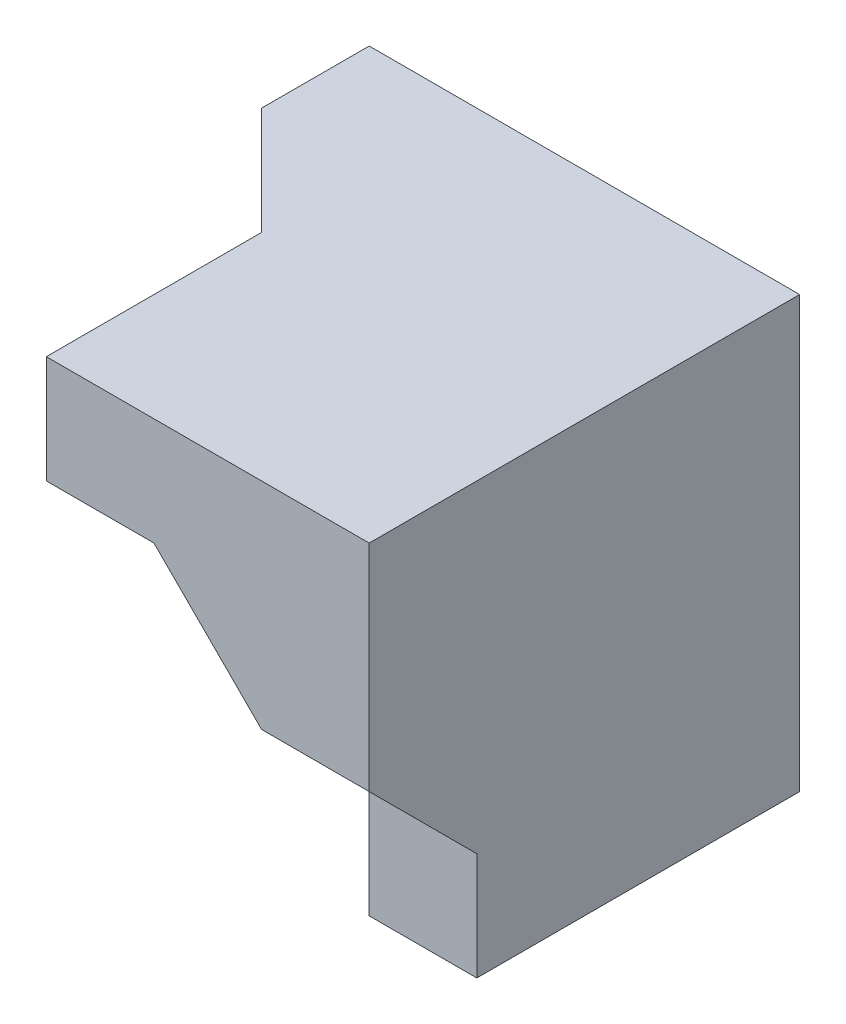
ISO-10303-21;
HEADER;
FILE_DESCRIPTION(('STEP AP214'),'2;1');
FILE_NAME('part.step','',(''),(''),'','','');
FILE_SCHEMA(('AUTOMOTIVE_DESIGN { 1 0 10303 214 1 1 1 1 }'));
ENDSEC;
DATA;
#1=APPLICATION_CONTEXT('core data for automotive mechanical design processes');
#2=APPLICATION_PROTOCOL_DEFINITION('international standard','automotive_design',2000,#1);
#3=PRODUCT_CONTEXT('',#1,'mechanical');
#4=PRODUCT('Part','Part','',(#3));
#5=PRODUCT_RELATED_PRODUCT_CATEGORY('part','',(#4));
#6=PRODUCT_DEFINITION_FORMATION('','',#4);
#7=PRODUCT_DEFINITION_CONTEXT('part definition',#1,'design');
#8=PRODUCT_DEFINITION('design','',#6,#7);
#9=PRODUCT_DEFINITION_SHAPE('','',#8);
#10=(LENGTH_UNIT() NAMED_UNIT(*) SI_UNIT(.MILLI.,.METRE.));
#11=(NAMED_UNIT(*) PLANE_ANGLE_UNIT() SI_UNIT($,.RADIAN.));
#12=(NAMED_UNIT(*) SI_UNIT($,.STERADIAN.) SOLID_ANGLE_UNIT());
#13=UNCERTAINTY_MEASURE_WITH_UNIT(LENGTH_MEASURE(1.E-05),#10,'distance_accuracy_value','');
#14=(GEOMETRIC_REPRESENTATION_CONTEXT(3) GLOBAL_UNCERTAINTY_ASSIGNED_CONTEXT((#13)) GLOBAL_UNIT_ASSIGNED_CONTEXT((#10,
#11,#12)) REPRESENTATION_CONTEXT('',''));
#15=CARTESIAN_POINT('',(0.,0.,0.));
#16=DIRECTION('',(0.,0.,1.));
#17=DIRECTION('',(1.,0.,0.));
#18=AXIS2_PLACEMENT_3D('',#15,#16,#17);
#19=CARTESIAN_POINT('',(0.,0.,20.));
#20=DIRECTION('',(0.,0.,-1.));
#21=DIRECTION('',(-1.,0.,0.));
#22=AXIS2_PLACEMENT_3D('',#19,#20,#21);
#23=PLANE('',#22);
#24=DIRECTION('',(0.,-1.,0.));
#25=VECTOR('',#24,1.);
#26=CARTESIAN_POINT('',(10.,30.,20.));
#27=LINE('',#26,#25);
#28=CARTESIAN_POINT('',(10.,30.,20.));
#29=VERTEX_POINT('',#28);
#30=CARTESIAN_POINT('',(9.99999999999999,20.,20.));
#31=VERTEX_POINT('',#30);
#32=EDGE_CURVE('E550',#29,#31,#27,.T.);
#33=ORIENTED_EDGE('',*,*,#32,.F.);
#34=DIRECTION('',(1.,0.,0.));
#35=VECTOR('',#34,1.);
#36=CARTESIAN_POINT('',(0.,30.,20.));
#37=LINE('',#36,#35);
#38=CARTESIAN_POINT('',(0.,30.,20.));
#39=VERTEX_POINT('',#38);
#40=EDGE_CURVE('E212',#39,#29,#37,.T.);
#41=ORIENTED_EDGE('',*,*,#40,.F.);
#42=DIRECTION('',(0.,1.,0.));
#43=VECTOR('',#42,1.);
#44=CARTESIAN_POINT('',(0.,40.,20.));
#45=LINE('',#44,#43);
#46=CARTESIAN_POINT('',(0.,20.,20.));
#47=VERTEX_POINT('',#46);
#48=EDGE_CURVE('E226',#47,#39,#45,.T.);
#49=ORIENTED_EDGE('',*,*,#48,.F.);
#50=DIRECTION('',(1.,0.,0.));
#51=VECTOR('',#50,1.);
#52=CARTESIAN_POINT('',(0.,20.,20.));
#53=LINE('',#52,#51);
#54=EDGE_CURVE('E235',#47,#31,#53,.T.);
#55=ORIENTED_EDGE('',*,*,#54,.T.);
#56=EDGE_LOOP('',(#33,#41,#49,#55));
#57=FACE_BOUND('',#56,.T.);
#58=ADVANCED_FACE('F35',(#57),#23,.F.);
#59=CARTESIAN_POINT('',(30.,0.,0.));
#60=DIRECTION('',(1.,0.,0.));
#61=DIRECTION('',(0.,0.,-1.));
#62=AXIS2_PLACEMENT_3D('',#59,#60,#61);
#63=PLANE('',#62);
#64=DIRECTION('',(0.,1.,0.));
#65=VECTOR('',#64,1.);
#66=CARTESIAN_POINT('',(30.,0.,30.));
#67=LINE('',#66,#65);
#68=CARTESIAN_POINT('',(30.,0.,30.));
#69=VERTEX_POINT('',#68);
#70=CARTESIAN_POINT('',(30.,9.99999999999999,30.));
#71=VERTEX_POINT('',#70);
#72=EDGE_CURVE('E163',#69,#71,#67,.T.);
#73=ORIENTED_EDGE('',*,*,#72,.T.);
#74=DIRECTION('',(0.,-0.707106781186547,-0.707106781186548));
#75=VECTOR('',#74,1.);
#76=CARTESIAN_POINT('',(30.,0.,20.));
#77=LINE('',#76,#75);
#78=CARTESIAN_POINT('',(30.,0.,20.));
#79=VERTEX_POINT('',#78);
#80=EDGE_CURVE('E146',#71,#79,#77,.T.);
#81=ORIENTED_EDGE('',*,*,#80,.T.);
#82=DIRECTION('',(0.,0.,1.));
#83=VECTOR('',#82,1.);
#84=CARTESIAN_POINT('',(30.,0.,0.));
#85=LINE('',#84,#83);
#86=EDGE_CURVE('E160',#79,#69,#85,.T.);
#87=ORIENTED_EDGE('',*,*,#86,.T.);
#88=EDGE_LOOP('',(#73,#81,#87));
#89=FACE_BOUND('',#88,.T.);
#90=ADVANCED_FACE('F158',(#89),#63,.F.);
#91=CARTESIAN_POINT('',(10.,40.,-5.00000000000001));
#92=DIRECTION('',(1.,0.,0.));
#93=DIRECTION('',(0.,1.,0.));
#94=AXIS2_PLACEMENT_3D('',#91,#92,#93);
#95=PLANE('',#94);
#96=DIRECTION('',(0.,0.,1.));
#97=VECTOR('',#96,1.);
#98=CARTESIAN_POINT('',(10.,20.,20.));
#99=LINE('',#98,#97);
#100=CARTESIAN_POINT('',(10.,20.,0.));
#101=VERTEX_POINT('',#100);
#102=CARTESIAN_POINT('',(10.,19.9999999999998,10.));
#103=VERTEX_POINT('',#102);
#104=EDGE_CURVE('E224',#101,#103,#99,.T.);
#105=ORIENTED_EDGE('',*,*,#104,.F.);
#106=DIRECTION('',(0.,-1.,0.));
#107=VECTOR('',#106,1.);
#108=CARTESIAN_POINT('',(10.,0.,0.));
#109=LINE('',#108,#107);
#110=CARTESIAN_POINT('',(10.,10.,0.));
#111=VERTEX_POINT('',#110);
#112=EDGE_CURVE('E44',#101,#111,#109,.T.);
#113=ORIENTED_EDGE('',*,*,#112,.T.);
#114=DIRECTION('',(0.,0.,1.));
#115=VECTOR('',#114,1.);
#116=CARTESIAN_POINT('',(10.,10.,-5.00000000000001));
#117=LINE('',#116,#115);
#118=CARTESIAN_POINT('',(10.,10.,10.));
#119=VERTEX_POINT('',#118);
#120=EDGE_CURVE('E11',#111,#119,#117,.T.);
#121=ORIENTED_EDGE('',*,*,#120,.T.);
#122=DIRECTION('',(0.,-1.,0.));
#123=VECTOR('',#122,1.);
#124=CARTESIAN_POINT('',(10.,19.9999999999998,10.));
#125=LINE('',#124,#123);
#126=EDGE_CURVE('E242',#103,#119,#125,.T.);
#127=ORIENTED_EDGE('',*,*,#126,.F.);
#128=EDGE_LOOP('',(#105,#113,#121,#127));
#129=FACE_BOUND('',#128,.T.);
#130=ADVANCED_FACE('F317',(#129),#95,.F.);
#131=CARTESIAN_POINT('',(30.,0.,0.));
#132=DIRECTION('',(0.,1.,0.));
#133=DIRECTION('',(0.,0.,1.));
#134=AXIS2_PLACEMENT_3D('',#131,#132,#133);
#135=PLANE('',#134);
#136=ORIENTED_EDGE('',*,*,#86,.F.);
#137=DIRECTION('',(0.,0.,1.));
#138=VECTOR('',#137,1.);
#139=CARTESIAN_POINT('',(30.,0.,10.));
#140=LINE('',#139,#138);
#141=CARTESIAN_POINT('',(30.,0.,10.));
#142=VERTEX_POINT('',#141);
#143=EDGE_CURVE('E166',#142,#79,#140,.T.);
#144=ORIENTED_EDGE('',*,*,#143,.F.);
#145=DIRECTION('',(1.,0.,0.));
#146=VECTOR('',#145,1.);
#147=CARTESIAN_POINT('',(20.,0.,10.));
#148=LINE('',#147,#146);
#149=CARTESIAN_POINT('',(20.,0.,10.));
#150=VERTEX_POINT('',#149);
#151=EDGE_CURVE('E153',#150,#142,#148,.T.);
#152=ORIENTED_EDGE('',*,*,#151,.F.);
#153=DIRECTION('',(0.,0.,1.));
#154=VECTOR('',#153,1.);
#155=CARTESIAN_POINT('',(20.,0.,-5.00000000000001));
#156=LINE('',#155,#154);
#157=CARTESIAN_POINT('',(20.,0.,0.));
#158=VERTEX_POINT('',#157);
#159=EDGE_CURVE('E244',#158,#150,#156,.T.);
#160=ORIENTED_EDGE('',*,*,#159,.F.);
#161=DIRECTION('',(1.,0.,0.));
#162=VECTOR('',#161,1.);
#163=CARTESIAN_POINT('',(0.,0.,0.));
#164=LINE('',#163,#162);
#165=CARTESIAN_POINT('',(40.,0.,0.));
#166=VERTEX_POINT('',#165);
#167=EDGE_CURVE('E249',#158,#166,#164,.T.);
#168=ORIENTED_EDGE('',*,*,#167,.T.);
#169=DIRECTION('',(0.,0.,1.));
#170=VECTOR('',#169,1.);
#171=CARTESIAN_POINT('',(40.,0.,0.));
#172=LINE('',#171,#170);
#173=CARTESIAN_POINT('',(40.,0.,30.));
#174=VERTEX_POINT('',#173);
#175=EDGE_CURVE('E181',#166,#174,#172,.T.);
#176=ORIENTED_EDGE('',*,*,#175,.T.);
#177=DIRECTION('',(1.,0.,0.));
#178=VECTOR('',#177,1.);
#179=CARTESIAN_POINT('',(30.,0.,30.));
#180=LINE('',#179,#178);
#181=EDGE_CURVE('E178',#69,#174,#180,.T.);
#182=ORIENTED_EDGE('',*,*,#181,.F.);
#183=EDGE_LOOP('',(#136,#144,#152,#160,#168,#176,#182));
#184=FACE_BOUND('',#183,.T.);
#185=ADVANCED_FACE('F176',(#184),#135,.F.);
#186=CARTESIAN_POINT('',(30.,0.,30.));
#187=DIRECTION('',(0.,0.,-1.));
#188=DIRECTION('',(-1.,0.,0.));
#189=AXIS2_PLACEMENT_3D('',#186,#187,#188);
#190=PLANE('',#189);
#191=DIRECTION('',(0.,1.,0.));
#192=VECTOR('',#191,1.);
#193=CARTESIAN_POINT('',(40.,0.,30.));
#194=LINE('',#193,#192);
#195=CARTESIAN_POINT('',(40.,10.,30.));
#196=VERTEX_POINT('',#195);
#197=EDGE_CURVE('E190',#174,#196,#194,.T.);
#198=ORIENTED_EDGE('',*,*,#197,.T.);
#199=DIRECTION('',(-1.,0.,0.));
#200=VECTOR('',#199,1.);
#201=CARTESIAN_POINT('',(40.,10.,30.));
#202=LINE('',#201,#200);
#203=EDGE_CURVE('E203',#196,#71,#202,.T.);
#204=ORIENTED_EDGE('',*,*,#203,.T.);
#205=ORIENTED_EDGE('',*,*,#72,.F.);
#206=ORIENTED_EDGE('',*,*,#181,.T.);
#207=EDGE_LOOP('',(#198,#204,#205,#206));
#208=FACE_BOUND('',#207,.T.);
#209=ADVANCED_FACE('F37',(#208),#190,.F.);
#210=CARTESIAN_POINT('',(40.,0.,0.));
#211=DIRECTION('',(1.,0.,0.));
#212=DIRECTION('',(0.,0.,-1.));
#213=AXIS2_PLACEMENT_3D('',#210,#211,#212);
#214=PLANE('',#213);
#215=DIRECTION('',(0.,0.,-1.));
#216=VECTOR('',#215,1.);
#217=CARTESIAN_POINT('',(40.,40.,20.));
#218=LINE('',#217,#216);
#219=CARTESIAN_POINT('',(40.,40.,40.));
#220=VERTEX_POINT('',#219);
#221=CARTESIAN_POINT('',(40.,40.,0.));
#222=VERTEX_POINT('',#221);
#223=EDGE_CURVE('E193',#220,#222,#218,.T.);
#224=ORIENTED_EDGE('',*,*,#223,.F.);
#225=DIRECTION('',(0.,1.,0.));
#226=VECTOR('',#225,1.);
#227=CARTESIAN_POINT('',(40.,20.,40.));
#228=LINE('',#227,#226);
#229=CARTESIAN_POINT('',(40.,20.,40.));
#230=VERTEX_POINT('',#229);
#231=EDGE_CURVE('E207',#230,#220,#228,.T.);
#232=ORIENTED_EDGE('',*,*,#231,.F.);
#233=DIRECTION('',(0.,0.707106781186547,0.707106781186548));
#234=VECTOR('',#233,1.);
#235=CARTESIAN_POINT('',(40.,10.,30.));
#236=LINE('',#235,#234);
#237=EDGE_CURVE('E199',#196,#230,#236,.T.);
#238=ORIENTED_EDGE('',*,*,#237,.F.);
#239=ORIENTED_EDGE('',*,*,#197,.F.);
#240=ORIENTED_EDGE('',*,*,#175,.F.);
#241=DIRECTION('',(0.,1.,0.));
#242=VECTOR('',#241,1.);
#243=CARTESIAN_POINT('',(40.,0.,0.));
#244=LINE('',#243,#242);
#245=EDGE_CURVE('E251',#166,#222,#244,.T.);
#246=ORIENTED_EDGE('',*,*,#245,.T.);
#247=EDGE_LOOP('',(#224,#232,#238,#239,#240,#246));
#248=FACE_BOUND('',#247,.T.);
#249=ADVANCED_FACE('F307',(#248),#214,.T.);
#250=CARTESIAN_POINT('',(0.,40.,20.));
#251=DIRECTION('',(0.,-1.,0.));
#252=DIRECTION('',(0.,0.,-1.));
#253=AXIS2_PLACEMENT_3D('',#250,#251,#252);
#254=PLANE('',#253);
#255=DIRECTION('',(-0.707106781186548,0.,-0.707106781186548));
#256=VECTOR('',#255,1.);
#257=CARTESIAN_POINT('',(10.,40.,20.));
#258=LINE('',#257,#256);
#259=CARTESIAN_POINT('',(10.,40.,20.));
#260=VERTEX_POINT('',#259);
#261=CARTESIAN_POINT('',(0.,40.,10.));
#262=VERTEX_POINT('',#261);
#263=EDGE_CURVE('E214',#260,#262,#258,.T.);
#264=ORIENTED_EDGE('',*,*,#263,.F.);
#265=DIRECTION('',(0.,0.,-1.));
#266=VECTOR('',#265,1.);
#267=CARTESIAN_POINT('',(10.,40.,40.));
#268=LINE('',#267,#266);
#269=CARTESIAN_POINT('',(10.,40.,40.));
#270=VERTEX_POINT('',#269);
#271=EDGE_CURVE('E281',#270,#260,#268,.T.);
#272=ORIENTED_EDGE('',*,*,#271,.F.);
#273=DIRECTION('',(-1.,0.,0.));
#274=VECTOR('',#273,1.);
#275=CARTESIAN_POINT('',(40.,40.,40.));
#276=LINE('',#275,#274);
#277=EDGE_CURVE('E220',#220,#270,#276,.T.);
#278=ORIENTED_EDGE('',*,*,#277,.F.);
#279=ORIENTED_EDGE('',*,*,#223,.T.);
#280=DIRECTION('',(-1.,0.,0.));
#281=VECTOR('',#280,1.);
#282=CARTESIAN_POINT('',(0.,40.,0.));
#283=LINE('',#282,#281);
#284=CARTESIAN_POINT('',(0.,40.,0.));
#285=VERTEX_POINT('',#284);
#286=EDGE_CURVE('E253',#222,#285,#283,.T.);
#287=ORIENTED_EDGE('',*,*,#286,.T.);
#288=DIRECTION('',(0.,0.,-1.));
#289=VECTOR('',#288,1.);
#290=CARTESIAN_POINT('',(0.,40.,20.));
#291=LINE('',#290,#289);
#292=EDGE_CURVE('E229',#262,#285,#291,.T.);
#293=ORIENTED_EDGE('',*,*,#292,.F.);
#294=EDGE_LOOP('',(#264,#272,#278,#279,#287,#293));
#295=FACE_BOUND('',#294,.T.);
#296=ADVANCED_FACE('F260',(#295),#254,.F.);
#297=CARTESIAN_POINT('',(0.,0.,0.));
#298=DIRECTION('',(0.,0.,-1.));
#299=DIRECTION('',(-1.,0.,0.));
#300=AXIS2_PLACEMENT_3D('',#297,#298,#299);
#301=PLANE('',#300);
#302=DIRECTION('',(0.707106781186548,-0.707106781186548,0.));
#303=VECTOR('',#302,1.);
#304=CARTESIAN_POINT('',(10.,10.,0.));
#305=LINE('',#304,#303);
#306=EDGE_CURVE('E247',#111,#158,#305,.T.);
#307=ORIENTED_EDGE('',*,*,#306,.F.);
#308=ORIENTED_EDGE('',*,*,#112,.F.);
#309=DIRECTION('',(1.,0.,0.));
#310=VECTOR('',#309,1.);
#311=CARTESIAN_POINT('',(0.,20.,0.));
#312=LINE('',#311,#310);
#313=CARTESIAN_POINT('',(0.,20.,0.));
#314=VERTEX_POINT('',#313);
#315=EDGE_CURVE('E154',#314,#101,#312,.T.);
#316=ORIENTED_EDGE('',*,*,#315,.F.);
#317=DIRECTION('',(0.,-1.,0.));
#318=VECTOR('',#317,1.);
#319=CARTESIAN_POINT('',(0.,40.,0.));
#320=LINE('',#319,#318);
#321=EDGE_CURVE('E231',#285,#314,#320,.T.);
#322=ORIENTED_EDGE('',*,*,#321,.F.);
#323=ORIENTED_EDGE('',*,*,#286,.F.);
#324=ORIENTED_EDGE('',*,*,#245,.F.);
#325=ORIENTED_EDGE('',*,*,#167,.F.);
#326=EDGE_LOOP('',(#307,#308,#316,#322,#323,#324,#325));
#327=FACE_BOUND('',#326,.T.);
#328=ADVANCED_FACE('F270',(#327),#301,.T.);
#329=CARTESIAN_POINT('',(10.,10.,-5.00000000000001));
#330=DIRECTION('',(0.707106781186548,0.707106781186548,0.));
#331=DIRECTION('',(-0.707106781186548,0.707106781186548,0.));
#332=AXIS2_PLACEMENT_3D('',#329,#330,#331);
#333=PLANE('',#332);
#334=ORIENTED_EDGE('',*,*,#159,.T.);
#335=DIRECTION('',(0.707106781186548,-0.707106781186547,0.));
#336=VECTOR('',#335,1.);
#337=CARTESIAN_POINT('',(10.,10.,10.));
#338=LINE('',#337,#336);
#339=EDGE_CURVE('E174',#119,#150,#338,.T.);
#340=ORIENTED_EDGE('',*,*,#339,.F.);
#341=ORIENTED_EDGE('',*,*,#120,.F.);
#342=ORIENTED_EDGE('',*,*,#306,.T.);
#343=EDGE_LOOP('',(#334,#340,#341,#342));
#344=FACE_BOUND('',#343,.T.);
#345=ADVANCED_FACE('F330',(#344),#333,.F.);
#346=CARTESIAN_POINT('',(30.,0.,10.));
#347=DIRECTION('',(0.707106781186544,0.707106781186551,0.));
#348=DIRECTION('',(-0.707106781186551,0.707106781186544,0.));
#349=AXIS2_PLACEMENT_3D('',#346,#347,#348);
#350=PLANE('',#349);
#351=DIRECTION('',(-0.707106781186551,0.707106781186544,0.));
#352=VECTOR('',#351,1.);
#353=CARTESIAN_POINT('',(30.,0.,20.));
#354=LINE('',#353,#352);
#355=EDGE_CURVE('E143',#79,#31,#354,.T.);
#356=ORIENTED_EDGE('',*,*,#355,.T.);
#357=DIRECTION('',(0.,0.,1.));
#358=VECTOR('',#357,1.);
#359=CARTESIAN_POINT('',(10.,19.9999999999998,10.));
#360=LINE('',#359,#358);
#361=EDGE_CURVE('E173',#103,#31,#360,.T.);
#362=ORIENTED_EDGE('',*,*,#361,.F.);
#363=DIRECTION('',(-0.707106781186551,0.707106781186544,0.));
#364=VECTOR('',#363,1.);
#365=CARTESIAN_POINT('',(30.,0.,10.));
#366=LINE('',#365,#364);
#367=EDGE_CURVE('E169',#142,#103,#366,.T.);
#368=ORIENTED_EDGE('',*,*,#367,.F.);
#369=ORIENTED_EDGE('',*,*,#143,.T.);
#370=EDGE_LOOP('',(#356,#362,#368,#369));
#371=FACE_BOUND('',#370,.T.);
#372=ADVANCED_FACE('F167',(#371),#350,.F.);
#373=CARTESIAN_POINT('',(0.,0.,10.));
#374=DIRECTION('',(0.,0.,-1.));
#375=DIRECTION('',(-1.,0.,0.));
#376=AXIS2_PLACEMENT_3D('',#373,#374,#375);
#377=PLANE('',#376);
#378=ORIENTED_EDGE('',*,*,#151,.T.);
#379=ORIENTED_EDGE('',*,*,#367,.T.);
#380=ORIENTED_EDGE('',*,*,#126,.T.);
#381=ORIENTED_EDGE('',*,*,#339,.T.);
#382=EDGE_LOOP('',(#378,#379,#380,#381));
#383=FACE_BOUND('',#382,.T.);
#384=ADVANCED_FACE('F355',(#383),#377,.F.);
#385=CARTESIAN_POINT('',(0.,20.,20.));
#386=DIRECTION('',(0.,1.,0.));
#387=DIRECTION('',(0.,0.,1.));
#388=AXIS2_PLACEMENT_3D('',#385,#386,#387);
#389=PLANE('',#388);
#390=ORIENTED_EDGE('',*,*,#104,.T.);
#391=ORIENTED_EDGE('',*,*,#361,.T.);
#392=ORIENTED_EDGE('',*,*,#54,.F.);
#393=DIRECTION('',(0.,0.,1.));
#394=VECTOR('',#393,1.);
#395=CARTESIAN_POINT('',(0.,20.,20.));
#396=LINE('',#395,#394);
#397=EDGE_CURVE('E233',#314,#47,#396,.T.);
#398=ORIENTED_EDGE('',*,*,#397,.F.);
#399=ORIENTED_EDGE('',*,*,#315,.T.);
#400=EDGE_LOOP('',(#390,#391,#392,#398,#399));
#401=FACE_BOUND('',#400,.T.);
#402=ADVANCED_FACE('F362',(#401),#389,.F.);
#403=CARTESIAN_POINT('',(0.,0.,0.));
#404=DIRECTION('',(1.,0.,0.));
#405=DIRECTION('',(0.,1.,0.));
#406=AXIS2_PLACEMENT_3D('',#403,#404,#405);
#407=PLANE('',#406);
#408=DIRECTION('',(0.,0.,1.));
#409=VECTOR('',#408,1.);
#410=CARTESIAN_POINT('',(0.,30.,10.));
#411=LINE('',#410,#409);
#412=CARTESIAN_POINT('',(0.,30.,10.));
#413=VERTEX_POINT('',#412);
#414=EDGE_CURVE('E216',#413,#39,#411,.T.);
#415=ORIENTED_EDGE('',*,*,#414,.F.);
#416=DIRECTION('',(0.,1.,0.));
#417=VECTOR('',#416,1.);
#418=CARTESIAN_POINT('',(0.,30.,10.));
#419=LINE('',#418,#417);
#420=EDGE_CURVE('E221',#413,#262,#419,.T.);
#421=ORIENTED_EDGE('',*,*,#420,.T.);
#422=ORIENTED_EDGE('',*,*,#292,.T.);
#423=ORIENTED_EDGE('',*,*,#321,.T.);
#424=ORIENTED_EDGE('',*,*,#397,.T.);
#425=ORIENTED_EDGE('',*,*,#48,.T.);
#426=EDGE_LOOP('',(#415,#421,#422,#423,#424,#425));
#427=FACE_BOUND('',#426,.T.);
#428=ADVANCED_FACE('F278',(#427),#407,.F.);
#429=CARTESIAN_POINT('',(10.,30.,20.));
#430=DIRECTION('',(0.707106781186548,0.,-0.707106781186548));
#431=DIRECTION('',(-0.707106781186548,0.,-0.707106781186548));
#432=AXIS2_PLACEMENT_3D('',#429,#430,#431);
#433=PLANE('',#432);
#434=ORIENTED_EDGE('',*,*,#263,.T.);
#435=ORIENTED_EDGE('',*,*,#420,.F.);
#436=DIRECTION('',(-0.707106781186548,0.,-0.707106781186548));
#437=VECTOR('',#436,1.);
#438=CARTESIAN_POINT('',(10.,30.,20.));
#439=LINE('',#438,#437);
#440=EDGE_CURVE('E60',#29,#413,#439,.T.);
#441=ORIENTED_EDGE('',*,*,#440,.F.);
#442=DIRECTION('',(0.,1.,0.));
#443=VECTOR('',#442,1.);
#444=CARTESIAN_POINT('',(10.,30.,20.));
#445=LINE('',#444,#443);
#446=EDGE_CURVE('E218',#29,#260,#445,.T.);
#447=ORIENTED_EDGE('',*,*,#446,.T.);
#448=EDGE_LOOP('',(#434,#435,#441,#447));
#449=FACE_BOUND('',#448,.T.);
#450=ADVANCED_FACE('F377',(#449),#433,.F.);
#451=CARTESIAN_POINT('',(0.,30.,0.));
#452=DIRECTION('',(0.,-1.,0.));
#453=DIRECTION('',(0.,0.,-1.));
#454=AXIS2_PLACEMENT_3D('',#451,#452,#453);
#455=PLANE('',#454);
#456=ORIENTED_EDGE('',*,*,#40,.T.);
#457=ORIENTED_EDGE('',*,*,#440,.T.);
#458=ORIENTED_EDGE('',*,*,#414,.T.);
#459=EDGE_LOOP('',(#456,#457,#458));
#460=FACE_BOUND('',#459,.T.);
#461=ADVANCED_FACE('F383',(#460),#455,.F.);
#462=CARTESIAN_POINT('',(40.,20.,40.));
#463=DIRECTION('',(0.,0.,1.));
#464=DIRECTION('',(1.,0.,0.));
#465=AXIS2_PLACEMENT_3D('',#462,#463,#464);
#466=PLANE('',#465);
#467=DIRECTION('',(0.707106781186548,-0.707106781186547,0.));
#468=VECTOR('',#467,1.);
#469=CARTESIAN_POINT('',(30.,20.,40.));
#470=LINE('',#469,#468);
#471=CARTESIAN_POINT('',(20.,30.,40.));
#472=VERTEX_POINT('',#471);
#473=CARTESIAN_POINT('',(30.,20.,40.));
#474=VERTEX_POINT('',#473);
#475=EDGE_CURVE('E293',#472,#474,#470,.T.);
#476=ORIENTED_EDGE('',*,*,#475,.T.);
#477=DIRECTION('',(-1.,0.,0.));
#478=VECTOR('',#477,1.);
#479=CARTESIAN_POINT('',(40.,20.,40.));
#480=LINE('',#479,#478);
#481=EDGE_CURVE('E206',#230,#474,#480,.T.);
#482=ORIENTED_EDGE('',*,*,#481,.F.);
#483=ORIENTED_EDGE('',*,*,#231,.T.);
#484=ORIENTED_EDGE('',*,*,#277,.T.);
#485=DIRECTION('',(0.,1.,0.));
#486=VECTOR('',#485,1.);
#487=CARTESIAN_POINT('',(10.,40.,40.));
#488=LINE('',#487,#486);
#489=CARTESIAN_POINT('',(10.,30.,40.));
#490=VERTEX_POINT('',#489);
#491=EDGE_CURVE('E289',#490,#270,#488,.T.);
#492=ORIENTED_EDGE('',*,*,#491,.F.);
#493=DIRECTION('',(1.,0.,0.));
#494=VECTOR('',#493,1.);
#495=CARTESIAN_POINT('',(10.,30.,40.));
#496=LINE('',#495,#494);
#497=EDGE_CURVE('E200',#490,#472,#496,.T.);
#498=ORIENTED_EDGE('',*,*,#497,.T.);
#499=EDGE_LOOP('',(#476,#482,#483,#484,#492,#498));
#500=FACE_BOUND('',#499,.T.);
#501=ADVANCED_FACE('F306',(#500),#466,.T.);
#502=CARTESIAN_POINT('',(40.,10.,30.));
#503=DIRECTION('',(0.,-0.707106781186548,0.707106781186547));
#504=DIRECTION('',(0.,-0.707106781186547,-0.707106781186548));
#505=AXIS2_PLACEMENT_3D('',#502,#503,#504);
#506=PLANE('',#505);
#507=DIRECTION('',(0.,0.707106781186547,0.707106781186548));
#508=VECTOR('',#507,1.);
#509=CARTESIAN_POINT('',(30.,10.,30.));
#510=LINE('',#509,#508);
#511=EDGE_CURVE('E197',#71,#474,#510,.T.);
#512=ORIENTED_EDGE('',*,*,#511,.F.);
#513=ORIENTED_EDGE('',*,*,#203,.F.);
#514=ORIENTED_EDGE('',*,*,#237,.T.);
#515=ORIENTED_EDGE('',*,*,#481,.T.);
#516=EDGE_LOOP('',(#512,#513,#514,#515));
#517=FACE_BOUND('',#516,.T.);
#518=ADVANCED_FACE('F303',(#517),#506,.T.);
#519=CARTESIAN_POINT('',(10.,30.,40.));
#520=DIRECTION('',(0.,1.,0.));
#521=DIRECTION('',(0.,0.,1.));
#522=AXIS2_PLACEMENT_3D('',#519,#520,#521);
#523=PLANE('',#522);
#524=DIRECTION('',(0.,0.,1.));
#525=VECTOR('',#524,1.);
#526=CARTESIAN_POINT('',(10.,30.,40.));
#527=LINE('',#526,#525);
#528=CARTESIAN_POINT('',(10.,30.,30.));
#529=VERTEX_POINT('',#528);
#530=EDGE_CURVE('E290',#529,#490,#527,.T.);
#531=ORIENTED_EDGE('',*,*,#530,.F.);
#532=DIRECTION('',(0.707106781186547,0.,0.707106781186548));
#533=VECTOR('',#532,1.);
#534=CARTESIAN_POINT('',(20.,30.,40.));
#535=LINE('',#534,#533);
#536=EDGE_CURVE('E52',#529,#472,#535,.T.);
#537=ORIENTED_EDGE('',*,*,#536,.T.);
#538=ORIENTED_EDGE('',*,*,#497,.F.);
#539=EDGE_LOOP('',(#531,#537,#538));
#540=FACE_BOUND('',#539,.T.);
#541=ADVANCED_FACE('F401',(#540),#523,.F.);
#542=CARTESIAN_POINT('',(10.,0.,0.));
#543=DIRECTION('',(1.,0.,0.));
#544=DIRECTION('',(0.,0.,-1.));
#545=AXIS2_PLACEMENT_3D('',#542,#543,#544);
#546=PLANE('',#545);
#547=ORIENTED_EDGE('',*,*,#491,.T.);
#548=ORIENTED_EDGE('',*,*,#271,.T.);
#549=ORIENTED_EDGE('',*,*,#446,.F.);
#550=ORIENTED_EDGE('',*,*,#32,.T.);
#551=DIRECTION('',(0.,0.707106781186548,0.707106781186548));
#552=VECTOR('',#551,1.);
#553=CARTESIAN_POINT('',(10.,20.,20.));
#554=LINE('',#553,#552);
#555=EDGE_CURVE('E149',#31,#529,#554,.T.);
#556=ORIENTED_EDGE('',*,*,#555,.T.);
#557=ORIENTED_EDGE('',*,*,#530,.T.);
#558=EDGE_LOOP('',(#547,#548,#549,#550,#556,#557));
#559=FACE_BOUND('',#558,.T.);
#560=ADVANCED_FACE('F286',(#559),#546,.F.);
#561=CARTESIAN_POINT('',(3.33333333333333,3.33333333333333,-3.33333333333333));
#562=DIRECTION('',(-0.577350269189626,-0.577350269189626,0.577350269189626));
#563=DIRECTION('',(0.707106781186547,-0.707106781186547,0.));
#564=AXIS2_PLACEMENT_3D('',#561,#562,#563);
#565=PLANE('',#564);
#566=ORIENTED_EDGE('',*,*,#511,.T.);
#567=ORIENTED_EDGE('',*,*,#475,.F.);
#568=ORIENTED_EDGE('',*,*,#536,.F.);
#569=ORIENTED_EDGE('',*,*,#555,.F.);
#570=ORIENTED_EDGE('',*,*,#355,.F.);
#571=ORIENTED_EDGE('',*,*,#80,.F.);
#572=EDGE_LOOP('',(#566,#567,#568,#569,#570,#571));
#573=FACE_BOUND('',#572,.T.);
#574=ADVANCED_FACE('F145',(#573),#565,.T.);
#575=CLOSED_SHELL('',(#58,#90,#130,#185,#209,#249,#296,#328,#345,#372,#384,#402,#428,#450,#461,
#501,#518,#541,#560,#574));
#576=MANIFOLD_SOLID_BREP('B2',#575);
#577=ADVANCED_BREP_SHAPE_REPRESENTATION('',(#18,#576),#14);
#578=SHAPE_DEFINITION_REPRESENTATION(#9,#577);
ENDSEC;
END-ISO-10303-21;
